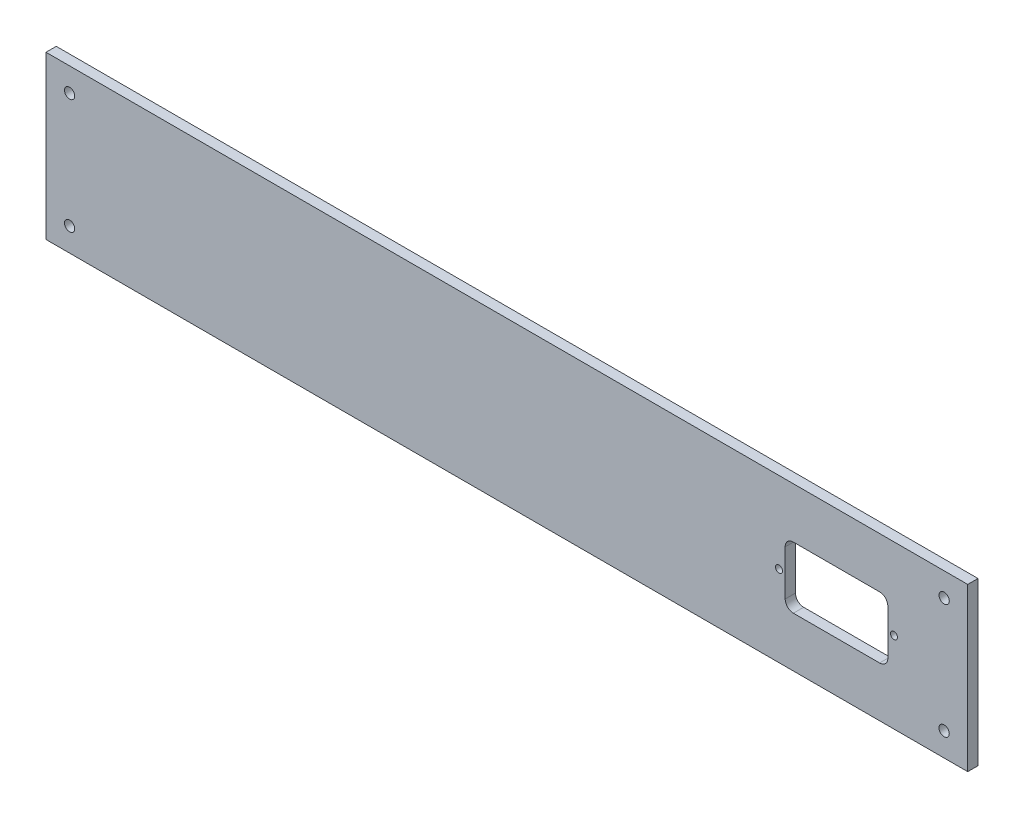
ISO-10303-21;
HEADER;
FILE_DESCRIPTION(('STEP AP214'),'2;1');
FILE_NAME('part.step','',(''),(''),'','','');
FILE_SCHEMA(('AUTOMOTIVE_DESIGN { 1 0 10303 214 1 1 1 1 }'));
ENDSEC;
DATA;
#1=APPLICATION_CONTEXT('core data for automotive mechanical design processes');
#2=APPLICATION_PROTOCOL_DEFINITION('international standard','automotive_design',2000,#1);
#3=PRODUCT_CONTEXT('',#1,'mechanical');
#4=PRODUCT('Part','Part','',(#3));
#5=PRODUCT_RELATED_PRODUCT_CATEGORY('part','',(#4));
#6=PRODUCT_DEFINITION_FORMATION('','',#4);
#7=PRODUCT_DEFINITION_CONTEXT('part definition',#1,'design');
#8=PRODUCT_DEFINITION('design','',#6,#7);
#9=PRODUCT_DEFINITION_SHAPE('','',#8);
#10=(LENGTH_UNIT() NAMED_UNIT(*) SI_UNIT(.MILLI.,.METRE.));
#11=(NAMED_UNIT(*) PLANE_ANGLE_UNIT() SI_UNIT($,.RADIAN.));
#12=(NAMED_UNIT(*) SI_UNIT($,.STERADIAN.) SOLID_ANGLE_UNIT());
#13=UNCERTAINTY_MEASURE_WITH_UNIT(LENGTH_MEASURE(1.E-05),#10,'distance_accuracy_value','');
#14=(GEOMETRIC_REPRESENTATION_CONTEXT(3) GLOBAL_UNCERTAINTY_ASSIGNED_CONTEXT((#13)) GLOBAL_UNIT_ASSIGNED_CONTEXT((#10,
#11,#12)) REPRESENTATION_CONTEXT('',''));
#15=CARTESIAN_POINT('',(0.,0.,0.));
#16=DIRECTION('',(0.,0.,1.));
#17=DIRECTION('',(1.,0.,0.));
#18=AXIS2_PLACEMENT_3D('',#15,#16,#17);
#19=CARTESIAN_POINT('',(0.,0.,5.));
#20=DIRECTION('',(0.,0.,-1.));
#21=DIRECTION('',(-1.,0.,0.));
#22=AXIS2_PLACEMENT_3D('',#19,#20,#21);
#23=PLANE('',#22);
#24=CARTESIAN_POINT('',(357.061242297895,39.5055064167184,5.));
#25=DIRECTION('',(0.,0.,-1.));
#26=DIRECTION('',(-1.,0.,0.));
#27=AXIS2_PLACEMENT_3D('',#24,#25,#26);
#28=CIRCLE('',#27,1.70000000000001);
#29=CARTESIAN_POINT('',(355.361242297895,39.5055064167184,5.));
#30=VERTEX_POINT('',#29);
#31=EDGE_CURVE('E279',#30,#30,#28,.T.);
#32=ORIENTED_EDGE('',*,*,#31,.T.);
#33=EDGE_LOOP('',(#32));
#34=FACE_BOUND('',#33,.T.);
#35=CARTESIAN_POINT('',(413.061242297895,39.5055064167184,5.));
#36=DIRECTION('',(0.,0.,-1.));
#37=DIRECTION('',(-1.,0.,0.));
#38=AXIS2_PLACEMENT_3D('',#35,#36,#37);
#39=CIRCLE('',#38,1.70000000000001);
#40=CARTESIAN_POINT('',(411.361242297895,39.5055064167184,5.));
#41=VERTEX_POINT('',#40);
#42=EDGE_CURVE('E180',#41,#41,#39,.T.);
#43=ORIENTED_EDGE('',*,*,#42,.T.);
#44=EDGE_LOOP('',(#43));
#45=FACE_BOUND('',#44,.T.);
#46=DIRECTION('',(0.,1.,0.));
#47=VECTOR('',#46,1.);
#48=CARTESIAN_POINT('',(360.074633799863,50.3949202589218,5.));
#49=LINE('',#48,#47);
#50=CARTESIAN_POINT('',(360.074633799863,28.3949202589218,5.));
#51=VERTEX_POINT('',#50);
#52=CARTESIAN_POINT('',(360.074633799863,50.3949202589218,5.));
#53=VERTEX_POINT('',#52);
#54=EDGE_CURVE('E143',#51,#53,#49,.T.);
#55=ORIENTED_EDGE('',*,*,#54,.T.);
#56=CARTESIAN_POINT('',(364.074633799863,50.3949202589218,5.));
#57=DIRECTION('',(0.,0.,-1.));
#58=DIRECTION('',(-1.,0.,0.));
#59=AXIS2_PLACEMENT_3D('',#56,#57,#58);
#60=CIRCLE('',#59,4.);
#61=CARTESIAN_POINT('',(364.074633799863,54.3949202589218,5.));
#62=VERTEX_POINT('',#61);
#63=EDGE_CURVE('E137',#53,#62,#60,.T.);
#64=ORIENTED_EDGE('',*,*,#63,.T.);
#65=DIRECTION('',(1.,0.,0.));
#66=VECTOR('',#65,1.);
#67=CARTESIAN_POINT('',(364.074633799863,54.3949202589218,5.));
#68=LINE('',#67,#66);
#69=CARTESIAN_POINT('',(406.074633799864,54.3949202589218,5.));
#70=VERTEX_POINT('',#69);
#71=EDGE_CURVE('E146',#62,#70,#68,.T.);
#72=ORIENTED_EDGE('',*,*,#71,.T.);
#73=CARTESIAN_POINT('',(406.074633799864,50.3949202589218,5.));
#74=DIRECTION('',(0.,0.,-1.));
#75=DIRECTION('',(1.,0.,0.));
#76=AXIS2_PLACEMENT_3D('',#73,#74,#75);
#77=CIRCLE('',#76,4.);
#78=CARTESIAN_POINT('',(410.074633799864,50.3949202589218,5.));
#79=VERTEX_POINT('',#78);
#80=EDGE_CURVE('E60',#70,#79,#77,.T.);
#81=ORIENTED_EDGE('',*,*,#80,.T.);
#82=DIRECTION('',(0.,-1.,0.));
#83=VECTOR('',#82,1.);
#84=CARTESIAN_POINT('',(410.074633799864,50.3949202589218,5.));
#85=LINE('',#84,#83);
#86=CARTESIAN_POINT('',(410.074633799864,28.3949202589218,5.));
#87=VERTEX_POINT('',#86);
#88=EDGE_CURVE('E165',#79,#87,#85,.T.);
#89=ORIENTED_EDGE('',*,*,#88,.T.);
#90=CARTESIAN_POINT('',(406.074633799864,28.3949202589218,5.));
#91=DIRECTION('',(0.,0.,-1.));
#92=DIRECTION('',(1.,0.,0.));
#93=AXIS2_PLACEMENT_3D('',#90,#91,#92);
#94=CIRCLE('',#93,4.);
#95=CARTESIAN_POINT('',(406.074633799864,24.3949202589218,5.));
#96=VERTEX_POINT('',#95);
#97=EDGE_CURVE('E168',#87,#96,#94,.T.);
#98=ORIENTED_EDGE('',*,*,#97,.T.);
#99=DIRECTION('',(-1.,0.,0.));
#100=VECTOR('',#99,1.);
#101=CARTESIAN_POINT('',(364.074633799863,24.3949202589218,5.));
#102=LINE('',#101,#100);
#103=CARTESIAN_POINT('',(364.074633799863,24.3949202589218,5.));
#104=VERTEX_POINT('',#103);
#105=EDGE_CURVE('E171',#96,#104,#102,.T.);
#106=ORIENTED_EDGE('',*,*,#105,.T.);
#107=CARTESIAN_POINT('',(364.074633799863,28.3949202589218,5.));
#108=DIRECTION('',(0.,0.,-1.));
#109=DIRECTION('',(1.,0.,0.));
#110=AXIS2_PLACEMENT_3D('',#107,#108,#109);
#111=CIRCLE('',#110,4.);
#112=EDGE_CURVE('E174',#104,#51,#111,.T.);
#113=ORIENTED_EDGE('',*,*,#112,.T.);
#114=EDGE_LOOP('',(#55,#64,#72,#81,#89,#98,#106,#113));
#115=FACE_BOUND('',#114,.T.);
#116=DIRECTION('',(1.,0.,0.));
#117=VECTOR('',#116,1.);
#118=CARTESIAN_POINT('',(449.,0.,5.));
#119=LINE('',#118,#117);
#120=CARTESIAN_POINT('',(0.,0.,5.));
#121=VERTEX_POINT('',#120);
#122=CARTESIAN_POINT('',(449.,0.,5.));
#123=VERTEX_POINT('',#122);
#124=EDGE_CURVE('E200',#121,#123,#119,.T.);
#125=ORIENTED_EDGE('',*,*,#124,.T.);
#126=DIRECTION('',(0.,1.,0.));
#127=VECTOR('',#126,1.);
#128=CARTESIAN_POINT('',(449.,79.,5.));
#129=LINE('',#128,#127);
#130=CARTESIAN_POINT('',(449.,79.,5.));
#131=VERTEX_POINT('',#130);
#132=EDGE_CURVE('E231',#123,#131,#129,.T.);
#133=ORIENTED_EDGE('',*,*,#132,.T.);
#134=DIRECTION('',(-1.,0.,0.));
#135=VECTOR('',#134,1.);
#136=CARTESIAN_POINT('',(0.,79.,5.));
#137=LINE('',#136,#135);
#138=CARTESIAN_POINT('',(0.,79.,5.));
#139=VERTEX_POINT('',#138);
#140=EDGE_CURVE('E214',#131,#139,#137,.T.);
#141=ORIENTED_EDGE('',*,*,#140,.T.);
#142=DIRECTION('',(0.,-1.,0.));
#143=VECTOR('',#142,1.);
#144=CARTESIAN_POINT('',(0.,0.,5.));
#145=LINE('',#144,#143);
#146=EDGE_CURVE('E205',#139,#121,#145,.T.);
#147=ORIENTED_EDGE('',*,*,#146,.T.);
#148=EDGE_LOOP('',(#125,#133,#141,#147));
#149=FACE_BOUND('',#148,.T.);
#150=CARTESIAN_POINT('',(11.5,67.5,5.));
#151=DIRECTION('',(0.,0.,1.));
#152=DIRECTION('',(1.,0.,0.));
#153=AXIS2_PLACEMENT_3D('',#150,#151,#152);
#154=CIRCLE('',#153,2.5);
#155=CARTESIAN_POINT('',(14.,67.5,5.));
#156=VERTEX_POINT('',#155);
#157=EDGE_CURVE('E240',#156,#156,#154,.T.);
#158=ORIENTED_EDGE('',*,*,#157,.F.);
#159=EDGE_LOOP('',(#158));
#160=FACE_BOUND('',#159,.T.);
#161=CARTESIAN_POINT('',(437.5,67.5,5.));
#162=DIRECTION('',(0.,0.,1.));
#163=DIRECTION('',(-1.,0.,0.));
#164=AXIS2_PLACEMENT_3D('',#161,#162,#163);
#165=CIRCLE('',#164,2.50000000000002);
#166=CARTESIAN_POINT('',(435.,67.5,5.));
#167=VERTEX_POINT('',#166);
#168=EDGE_CURVE('E246',#167,#167,#165,.T.);
#169=ORIENTED_EDGE('',*,*,#168,.F.);
#170=EDGE_LOOP('',(#169));
#171=FACE_BOUND('',#170,.T.);
#172=CARTESIAN_POINT('',(11.5,11.5,5.));
#173=DIRECTION('',(0.,0.,1.));
#174=DIRECTION('',(-1.,0.,0.));
#175=AXIS2_PLACEMENT_3D('',#172,#173,#174);
#176=CIRCLE('',#175,2.5);
#177=CARTESIAN_POINT('',(9.,11.5,5.));
#178=VERTEX_POINT('',#177);
#179=EDGE_CURVE('E252',#178,#178,#176,.T.);
#180=ORIENTED_EDGE('',*,*,#179,.F.);
#181=EDGE_LOOP('',(#180));
#182=FACE_BOUND('',#181,.T.);
#183=CARTESIAN_POINT('',(437.5,11.5,5.));
#184=DIRECTION('',(0.,0.,1.));
#185=DIRECTION('',(1.,0.,0.));
#186=AXIS2_PLACEMENT_3D('',#183,#184,#185);
#187=CIRCLE('',#186,2.50000000000002);
#188=CARTESIAN_POINT('',(440.,11.5,5.));
#189=VERTEX_POINT('',#188);
#190=EDGE_CURVE('E266',#189,#189,#187,.T.);
#191=ORIENTED_EDGE('',*,*,#190,.F.);
#192=EDGE_LOOP('',(#191));
#193=FACE_BOUND('',#192,.T.);
#194=ADVANCED_FACE('F45',(#34,#45,#115,#149,#160,#171,#182,#193),#23,.F.);
#195=CARTESIAN_POINT('',(0.,0.,0.));
#196=DIRECTION('',(0.,0.,-1.));
#197=DIRECTION('',(-1.,0.,0.));
#198=AXIS2_PLACEMENT_3D('',#195,#196,#197);
#199=PLANE('',#198);
#200=CARTESIAN_POINT('',(357.061242297895,39.5055064167184,0.));
#201=DIRECTION('',(0.,0.,-1.));
#202=DIRECTION('',(-1.,0.,0.));
#203=AXIS2_PLACEMENT_3D('',#200,#201,#202);
#204=CIRCLE('',#203,1.70000000000001);
#205=CARTESIAN_POINT('',(355.361242297895,39.5055064167184,0.));
#206=VERTEX_POINT('',#205);
#207=EDGE_CURVE('E274',#206,#206,#204,.T.);
#208=ORIENTED_EDGE('',*,*,#207,.F.);
#209=EDGE_LOOP('',(#208));
#210=FACE_BOUND('',#209,.T.);
#211=CARTESIAN_POINT('',(413.061242297895,39.5055064167184,0.));
#212=DIRECTION('',(0.,0.,-1.));
#213=DIRECTION('',(-1.,0.,0.));
#214=AXIS2_PLACEMENT_3D('',#211,#212,#213);
#215=CIRCLE('',#214,1.70000000000001);
#216=CARTESIAN_POINT('',(411.361242297895,39.5055064167184,0.));
#217=VERTEX_POINT('',#216);
#218=EDGE_CURVE('E160',#217,#217,#215,.T.);
#219=ORIENTED_EDGE('',*,*,#218,.F.);
#220=EDGE_LOOP('',(#219));
#221=FACE_BOUND('',#220,.T.);
#222=CARTESIAN_POINT('',(364.074633799863,50.3949202589218,0.));
#223=DIRECTION('',(0.,0.,-1.));
#224=DIRECTION('',(-1.,0.,0.));
#225=AXIS2_PLACEMENT_3D('',#222,#223,#224);
#226=CIRCLE('',#225,4.);
#227=CARTESIAN_POINT('',(360.074633799863,50.3949202589218,0.));
#228=VERTEX_POINT('',#227);
#229=CARTESIAN_POINT('',(364.074633799863,54.3949202589218,0.));
#230=VERTEX_POINT('',#229);
#231=EDGE_CURVE('E68',#228,#230,#226,.T.);
#232=ORIENTED_EDGE('',*,*,#231,.F.);
#233=DIRECTION('',(0.,1.,0.));
#234=VECTOR('',#233,1.);
#235=CARTESIAN_POINT('',(360.074633799863,50.3949202589218,0.));
#236=LINE('',#235,#234);
#237=CARTESIAN_POINT('',(360.074633799863,28.3949202589218,0.));
#238=VERTEX_POINT('',#237);
#239=EDGE_CURVE('E153',#238,#228,#236,.T.);
#240=ORIENTED_EDGE('',*,*,#239,.F.);
#241=CARTESIAN_POINT('',(364.074633799863,28.3949202589218,0.));
#242=DIRECTION('',(0.,0.,-1.));
#243=DIRECTION('',(1.,0.,0.));
#244=AXIS2_PLACEMENT_3D('',#241,#242,#243);
#245=CIRCLE('',#244,4.);
#246=CARTESIAN_POINT('',(364.074633799863,24.3949202589218,0.));
#247=VERTEX_POINT('',#246);
#248=EDGE_CURVE('E157',#247,#238,#245,.T.);
#249=ORIENTED_EDGE('',*,*,#248,.F.);
#250=DIRECTION('',(-1.,0.,0.));
#251=VECTOR('',#250,1.);
#252=CARTESIAN_POINT('',(364.074633799863,24.3949202589218,0.));
#253=LINE('',#252,#251);
#254=CARTESIAN_POINT('',(406.074633799864,24.3949202589218,0.));
#255=VERTEX_POINT('',#254);
#256=EDGE_CURVE('E311',#255,#247,#253,.T.);
#257=ORIENTED_EDGE('',*,*,#256,.F.);
#258=CARTESIAN_POINT('',(406.074633799864,28.3949202589218,0.));
#259=DIRECTION('',(0.,0.,-1.));
#260=DIRECTION('',(1.,0.,0.));
#261=AXIS2_PLACEMENT_3D('',#258,#259,#260);
#262=CIRCLE('',#261,4.);
#263=CARTESIAN_POINT('',(410.074633799864,28.3949202589218,0.));
#264=VERTEX_POINT('',#263);
#265=EDGE_CURVE('E307',#264,#255,#262,.T.);
#266=ORIENTED_EDGE('',*,*,#265,.F.);
#267=DIRECTION('',(0.,-1.,0.));
#268=VECTOR('',#267,1.);
#269=CARTESIAN_POINT('',(410.074633799864,50.3949202589218,0.));
#270=LINE('',#269,#268);
#271=CARTESIAN_POINT('',(410.074633799864,50.3949202589218,0.));
#272=VERTEX_POINT('',#271);
#273=EDGE_CURVE('E299',#272,#264,#270,.T.);
#274=ORIENTED_EDGE('',*,*,#273,.F.);
#275=CARTESIAN_POINT('',(406.074633799864,50.3949202589218,0.));
#276=DIRECTION('',(0.,0.,-1.));
#277=DIRECTION('',(1.,0.,0.));
#278=AXIS2_PLACEMENT_3D('',#275,#276,#277);
#279=CIRCLE('',#278,4.);
#280=CARTESIAN_POINT('',(406.074633799864,54.3949202589218,0.));
#281=VERTEX_POINT('',#280);
#282=EDGE_CURVE('E295',#281,#272,#279,.T.);
#283=ORIENTED_EDGE('',*,*,#282,.F.);
#284=DIRECTION('',(1.,0.,0.));
#285=VECTOR('',#284,1.);
#286=CARTESIAN_POINT('',(364.074633799863,54.3949202589218,0.));
#287=LINE('',#286,#285);
#288=EDGE_CURVE('E179',#230,#281,#287,.T.);
#289=ORIENTED_EDGE('',*,*,#288,.F.);
#290=EDGE_LOOP('',(#232,#240,#249,#257,#266,#274,#283,#289));
#291=FACE_BOUND('',#290,.T.);
#292=CARTESIAN_POINT('',(11.5,11.5,0.));
#293=DIRECTION('',(0.,0.,1.));
#294=DIRECTION('',(-1.,0.,0.));
#295=AXIS2_PLACEMENT_3D('',#292,#293,#294);
#296=CIRCLE('',#295,2.5);
#297=CARTESIAN_POINT('',(9.,11.5,0.));
#298=VERTEX_POINT('',#297);
#299=EDGE_CURVE('E285',#298,#298,#296,.T.);
#300=ORIENTED_EDGE('',*,*,#299,.T.);
#301=EDGE_LOOP('',(#300));
#302=FACE_BOUND('',#301,.T.);
#303=CARTESIAN_POINT('',(11.5,67.5,0.));
#304=DIRECTION('',(0.,0.,1.));
#305=DIRECTION('',(1.,0.,0.));
#306=AXIS2_PLACEMENT_3D('',#303,#304,#305);
#307=CIRCLE('',#306,2.5);
#308=CARTESIAN_POINT('',(14.,67.5,0.));
#309=VERTEX_POINT('',#308);
#310=EDGE_CURVE('E235',#309,#309,#307,.T.);
#311=ORIENTED_EDGE('',*,*,#310,.T.);
#312=EDGE_LOOP('',(#311));
#313=FACE_BOUND('',#312,.T.);
#314=DIRECTION('',(1.,0.,0.));
#315=VECTOR('',#314,1.);
#316=CARTESIAN_POINT('',(449.,0.,0.));
#317=LINE('',#316,#315);
#318=CARTESIAN_POINT('',(0.,0.,0.));
#319=VERTEX_POINT('',#318);
#320=CARTESIAN_POINT('',(449.,0.,0.));
#321=VERTEX_POINT('',#320);
#322=EDGE_CURVE('E222',#319,#321,#317,.T.);
#323=ORIENTED_EDGE('',*,*,#322,.F.);
#324=DIRECTION('',(0.,-1.,0.));
#325=VECTOR('',#324,1.);
#326=CARTESIAN_POINT('',(0.,0.,0.));
#327=LINE('',#326,#325);
#328=CARTESIAN_POINT('',(0.,79.,0.));
#329=VERTEX_POINT('',#328);
#330=EDGE_CURVE('E196',#329,#319,#327,.T.);
#331=ORIENTED_EDGE('',*,*,#330,.F.);
#332=DIRECTION('',(-1.,0.,0.));
#333=VECTOR('',#332,1.);
#334=CARTESIAN_POINT('',(0.,79.,0.));
#335=LINE('',#334,#333);
#336=CARTESIAN_POINT('',(449.,79.,0.));
#337=VERTEX_POINT('',#336);
#338=EDGE_CURVE('E192',#337,#329,#335,.T.);
#339=ORIENTED_EDGE('',*,*,#338,.F.);
#340=DIRECTION('',(0.,1.,0.));
#341=VECTOR('',#340,1.);
#342=CARTESIAN_POINT('',(449.,79.,0.));
#343=LINE('',#342,#341);
#344=EDGE_CURVE('E197',#321,#337,#343,.T.);
#345=ORIENTED_EDGE('',*,*,#344,.F.);
#346=EDGE_LOOP('',(#323,#331,#339,#345));
#347=FACE_BOUND('',#346,.T.);
#348=CARTESIAN_POINT('',(437.5,67.5,0.));
#349=DIRECTION('',(0.,0.,1.));
#350=DIRECTION('',(-1.,0.,0.));
#351=AXIS2_PLACEMENT_3D('',#348,#349,#350);
#352=CIRCLE('',#351,2.50000000000002);
#353=CARTESIAN_POINT('',(435.,67.5,0.));
#354=VERTEX_POINT('',#353);
#355=EDGE_CURVE('E247',#354,#354,#352,.T.);
#356=ORIENTED_EDGE('',*,*,#355,.T.);
#357=EDGE_LOOP('',(#356));
#358=FACE_BOUND('',#357,.T.);
#359=CARTESIAN_POINT('',(437.5,11.5,0.));
#360=DIRECTION('',(0.,0.,1.));
#361=DIRECTION('',(1.,0.,0.));
#362=AXIS2_PLACEMENT_3D('',#359,#360,#361);
#363=CIRCLE('',#362,2.50000000000002);
#364=CARTESIAN_POINT('',(440.,11.5,0.));
#365=VERTEX_POINT('',#364);
#366=EDGE_CURVE('E260',#365,#365,#363,.T.);
#367=ORIENTED_EDGE('',*,*,#366,.T.);
#368=EDGE_LOOP('',(#367));
#369=FACE_BOUND('',#368,.T.);
#370=ADVANCED_FACE('F219',(#210,#221,#291,#302,#313,#347,#358,#369),#199,.T.);
#371=CARTESIAN_POINT('',(449.,0.,5.));
#372=DIRECTION('',(0.,1.,0.));
#373=DIRECTION('',(-1.,0.,0.));
#374=AXIS2_PLACEMENT_3D('',#371,#372,#373);
#375=PLANE('',#374);
#376=ORIENTED_EDGE('',*,*,#322,.T.);
#377=DIRECTION('',(0.,0.,-1.));
#378=VECTOR('',#377,1.);
#379=CARTESIAN_POINT('',(449.,0.,5.));
#380=LINE('',#379,#378);
#381=EDGE_CURVE('E12',#123,#321,#380,.T.);
#382=ORIENTED_EDGE('',*,*,#381,.F.);
#383=ORIENTED_EDGE('',*,*,#124,.F.);
#384=DIRECTION('',(0.,0.,-1.));
#385=VECTOR('',#384,1.);
#386=CARTESIAN_POINT('',(0.,0.,5.));
#387=LINE('',#386,#385);
#388=EDGE_CURVE('E201',#121,#319,#387,.T.);
#389=ORIENTED_EDGE('',*,*,#388,.T.);
#390=EDGE_LOOP('',(#376,#382,#383,#389));
#391=FACE_BOUND('',#390,.T.);
#392=ADVANCED_FACE('F47',(#391),#375,.F.);
#393=CARTESIAN_POINT('',(449.,79.,5.));
#394=DIRECTION('',(-1.,0.,0.));
#395=DIRECTION('',(0.,0.,1.));
#396=AXIS2_PLACEMENT_3D('',#393,#394,#395);
#397=PLANE('',#396);
#398=ORIENTED_EDGE('',*,*,#344,.T.);
#399=DIRECTION('',(0.,0.,-1.));
#400=VECTOR('',#399,1.);
#401=CARTESIAN_POINT('',(449.,79.,5.));
#402=LINE('',#401,#400);
#403=EDGE_CURVE('E53',#131,#337,#402,.T.);
#404=ORIENTED_EDGE('',*,*,#403,.F.);
#405=ORIENTED_EDGE('',*,*,#132,.F.);
#406=ORIENTED_EDGE('',*,*,#381,.T.);
#407=EDGE_LOOP('',(#398,#404,#405,#406));
#408=FACE_BOUND('',#407,.T.);
#409=ADVANCED_FACE('F386',(#408),#397,.F.);
#410=CARTESIAN_POINT('',(0.,79.,5.));
#411=DIRECTION('',(0.,-1.,0.));
#412=DIRECTION('',(0.,0.,-1.));
#413=AXIS2_PLACEMENT_3D('',#410,#411,#412);
#414=PLANE('',#413);
#415=ORIENTED_EDGE('',*,*,#338,.T.);
#416=DIRECTION('',(0.,0.,-1.));
#417=VECTOR('',#416,1.);
#418=CARTESIAN_POINT('',(0.,79.,5.));
#419=LINE('',#418,#417);
#420=EDGE_CURVE('E204',#139,#329,#419,.T.);
#421=ORIENTED_EDGE('',*,*,#420,.F.);
#422=ORIENTED_EDGE('',*,*,#140,.F.);
#423=ORIENTED_EDGE('',*,*,#403,.T.);
#424=EDGE_LOOP('',(#415,#421,#422,#423));
#425=FACE_BOUND('',#424,.T.);
#426=ADVANCED_FACE('F212',(#425),#414,.F.);
#427=CARTESIAN_POINT('',(0.,0.,5.));
#428=DIRECTION('',(1.,0.,0.));
#429=DIRECTION('',(0.,1.,0.));
#430=AXIS2_PLACEMENT_3D('',#427,#428,#429);
#431=PLANE('',#430);
#432=ORIENTED_EDGE('',*,*,#330,.T.);
#433=ORIENTED_EDGE('',*,*,#388,.F.);
#434=ORIENTED_EDGE('',*,*,#146,.F.);
#435=ORIENTED_EDGE('',*,*,#420,.T.);
#436=EDGE_LOOP('',(#432,#433,#434,#435));
#437=FACE_BOUND('',#436,.T.);
#438=ADVANCED_FACE('F225',(#437),#431,.F.);
#439=CARTESIAN_POINT('',(11.5,67.5,5.));
#440=DIRECTION('',(0.,0.,-1.));
#441=DIRECTION('',(-1.,0.,0.));
#442=AXIS2_PLACEMENT_3D('',#439,#440,#441);
#443=CYLINDRICAL_SURFACE('',#442,2.5);
#444=ORIENTED_EDGE('',*,*,#157,.T.);
#445=EDGE_LOOP('',(#444));
#446=FACE_BOUND('',#445,.T.);
#447=ORIENTED_EDGE('',*,*,#310,.F.);
#448=EDGE_LOOP('',(#447));
#449=FACE_BOUND('',#448,.T.);
#450=ADVANCED_FACE('F380',(#446,#449),#443,.F.);
#451=CARTESIAN_POINT('',(437.5,67.5,5.));
#452=DIRECTION('',(0.,0.,-1.));
#453=DIRECTION('',(-1.,0.,0.));
#454=AXIS2_PLACEMENT_3D('',#451,#452,#453);
#455=CYLINDRICAL_SURFACE('',#454,2.50000000000002);
#456=ORIENTED_EDGE('',*,*,#168,.T.);
#457=EDGE_LOOP('',(#456));
#458=FACE_BOUND('',#457,.T.);
#459=ORIENTED_EDGE('',*,*,#355,.F.);
#460=EDGE_LOOP('',(#459));
#461=FACE_BOUND('',#460,.T.);
#462=ADVANCED_FACE('F415',(#458,#461),#455,.F.);
#463=CARTESIAN_POINT('',(11.5,11.5,5.));
#464=DIRECTION('',(0.,0.,-1.));
#465=DIRECTION('',(-1.,0.,0.));
#466=AXIS2_PLACEMENT_3D('',#463,#464,#465);
#467=CYLINDRICAL_SURFACE('',#466,2.5);
#468=ORIENTED_EDGE('',*,*,#179,.T.);
#469=EDGE_LOOP('',(#468));
#470=FACE_BOUND('',#469,.T.);
#471=ORIENTED_EDGE('',*,*,#299,.F.);
#472=EDGE_LOOP('',(#471));
#473=FACE_BOUND('',#472,.T.);
#474=ADVANCED_FACE('F405',(#470,#473),#467,.F.);
#475=CARTESIAN_POINT('',(437.5,11.5,5.));
#476=DIRECTION('',(0.,0.,-1.));
#477=DIRECTION('',(-1.,0.,0.));
#478=AXIS2_PLACEMENT_3D('',#475,#476,#477);
#479=CYLINDRICAL_SURFACE('',#478,2.50000000000002);
#480=ORIENTED_EDGE('',*,*,#190,.T.);
#481=EDGE_LOOP('',(#480));
#482=FACE_BOUND('',#481,.T.);
#483=ORIENTED_EDGE('',*,*,#366,.F.);
#484=EDGE_LOOP('',(#483));
#485=FACE_BOUND('',#484,.T.);
#486=ADVANCED_FACE('F402',(#482,#485),#479,.F.);
#487=CARTESIAN_POINT('',(364.074633799863,50.3949202589218,5.));
#488=DIRECTION('',(0.,0.,-1.));
#489=DIRECTION('',(-1.,0.,0.));
#490=AXIS2_PLACEMENT_3D('',#487,#488,#489);
#491=CYLINDRICAL_SURFACE('',#490,4.);
#492=ORIENTED_EDGE('',*,*,#231,.T.);
#493=DIRECTION('',(0.,0.,-1.));
#494=VECTOR('',#493,1.);
#495=CARTESIAN_POINT('',(364.074633799863,54.3949202589218,5.));
#496=LINE('',#495,#494);
#497=EDGE_CURVE('E133',#62,#230,#496,.T.);
#498=ORIENTED_EDGE('',*,*,#497,.F.);
#499=ORIENTED_EDGE('',*,*,#63,.F.);
#500=DIRECTION('',(0.,0.,-1.));
#501=VECTOR('',#500,1.);
#502=CARTESIAN_POINT('',(360.074633799863,50.3949202589218,5.));
#503=LINE('',#502,#501);
#504=EDGE_CURVE('E267',#53,#228,#503,.T.);
#505=ORIENTED_EDGE('',*,*,#504,.T.);
#506=EDGE_LOOP('',(#492,#498,#499,#505));
#507=FACE_BOUND('',#506,.T.);
#508=ADVANCED_FACE('F135',(#507),#491,.F.);
#509=CARTESIAN_POINT('',(360.074633799863,50.3949202589218,5.));
#510=DIRECTION('',(-1.,0.,0.));
#511=DIRECTION('',(0.,0.,1.));
#512=AXIS2_PLACEMENT_3D('',#509,#510,#511);
#513=PLANE('',#512);
#514=ORIENTED_EDGE('',*,*,#239,.T.);
#515=ORIENTED_EDGE('',*,*,#504,.F.);
#516=ORIENTED_EDGE('',*,*,#54,.F.);
#517=DIRECTION('',(0.,0.,-1.));
#518=VECTOR('',#517,1.);
#519=CARTESIAN_POINT('',(360.074633799863,28.3949202589218,5.));
#520=LINE('',#519,#518);
#521=EDGE_CURVE('E325',#51,#238,#520,.T.);
#522=ORIENTED_EDGE('',*,*,#521,.T.);
#523=EDGE_LOOP('',(#514,#515,#516,#522));
#524=FACE_BOUND('',#523,.T.);
#525=ADVANCED_FACE('F413',(#524),#513,.F.);
#526=CARTESIAN_POINT('',(364.074633799863,28.3949202589218,5.));
#527=DIRECTION('',(0.,0.,-1.));
#528=DIRECTION('',(-1.,0.,0.));
#529=AXIS2_PLACEMENT_3D('',#526,#527,#528);
#530=CYLINDRICAL_SURFACE('',#529,4.);
#531=ORIENTED_EDGE('',*,*,#248,.T.);
#532=ORIENTED_EDGE('',*,*,#521,.F.);
#533=ORIENTED_EDGE('',*,*,#112,.F.);
#534=DIRECTION('',(0.,0.,-1.));
#535=VECTOR('',#534,1.);
#536=CARTESIAN_POINT('',(364.074633799863,24.3949202589218,5.));
#537=LINE('',#536,#535);
#538=EDGE_CURVE('E327',#104,#247,#537,.T.);
#539=ORIENTED_EDGE('',*,*,#538,.T.);
#540=EDGE_LOOP('',(#531,#532,#533,#539));
#541=FACE_BOUND('',#540,.T.);
#542=ADVANCED_FACE('F355',(#541),#530,.F.);
#543=CARTESIAN_POINT('',(364.074633799863,24.3949202589218,5.));
#544=DIRECTION('',(0.,-1.,0.));
#545=DIRECTION('',(1.,0.,0.));
#546=AXIS2_PLACEMENT_3D('',#543,#544,#545);
#547=PLANE('',#546);
#548=ORIENTED_EDGE('',*,*,#256,.T.);
#549=ORIENTED_EDGE('',*,*,#538,.F.);
#550=ORIENTED_EDGE('',*,*,#105,.F.);
#551=DIRECTION('',(0.,0.,-1.));
#552=VECTOR('',#551,1.);
#553=CARTESIAN_POINT('',(406.074633799864,24.3949202589218,5.));
#554=LINE('',#553,#552);
#555=EDGE_CURVE('E329',#96,#255,#554,.T.);
#556=ORIENTED_EDGE('',*,*,#555,.T.);
#557=EDGE_LOOP('',(#548,#549,#550,#556));
#558=FACE_BOUND('',#557,.T.);
#559=ADVANCED_FACE('F350',(#558),#547,.F.);
#560=CARTESIAN_POINT('',(406.074633799864,28.3949202589218,5.));
#561=DIRECTION('',(0.,0.,-1.));
#562=DIRECTION('',(-1.,0.,0.));
#563=AXIS2_PLACEMENT_3D('',#560,#561,#562);
#564=CYLINDRICAL_SURFACE('',#563,4.);
#565=ORIENTED_EDGE('',*,*,#265,.T.);
#566=ORIENTED_EDGE('',*,*,#555,.F.);
#567=ORIENTED_EDGE('',*,*,#97,.F.);
#568=DIRECTION('',(0.,0.,-1.));
#569=VECTOR('',#568,1.);
#570=CARTESIAN_POINT('',(410.074633799864,28.3949202589218,5.));
#571=LINE('',#570,#569);
#572=EDGE_CURVE('E331',#87,#264,#571,.T.);
#573=ORIENTED_EDGE('',*,*,#572,.T.);
#574=EDGE_LOOP('',(#565,#566,#567,#573));
#575=FACE_BOUND('',#574,.T.);
#576=ADVANCED_FACE('F359',(#575),#564,.F.);
#577=CARTESIAN_POINT('',(410.074633799864,50.3949202589218,5.));
#578=DIRECTION('',(1.,0.,0.));
#579=DIRECTION('',(0.,0.,-1.));
#580=AXIS2_PLACEMENT_3D('',#577,#578,#579);
#581=PLANE('',#580);
#582=ORIENTED_EDGE('',*,*,#273,.T.);
#583=ORIENTED_EDGE('',*,*,#572,.F.);
#584=ORIENTED_EDGE('',*,*,#88,.F.);
#585=DIRECTION('',(0.,0.,-1.));
#586=VECTOR('',#585,1.);
#587=CARTESIAN_POINT('',(410.074633799864,50.3949202589218,5.));
#588=LINE('',#587,#586);
#589=EDGE_CURVE('E333',#79,#272,#588,.T.);
#590=ORIENTED_EDGE('',*,*,#589,.T.);
#591=EDGE_LOOP('',(#582,#583,#584,#590));
#592=FACE_BOUND('',#591,.T.);
#593=ADVANCED_FACE('F360',(#592),#581,.F.);
#594=CARTESIAN_POINT('',(406.074633799864,50.3949202589218,5.));
#595=DIRECTION('',(0.,0.,-1.));
#596=DIRECTION('',(-1.,0.,0.));
#597=AXIS2_PLACEMENT_3D('',#594,#595,#596);
#598=CYLINDRICAL_SURFACE('',#597,4.);
#599=ORIENTED_EDGE('',*,*,#282,.T.);
#600=ORIENTED_EDGE('',*,*,#589,.F.);
#601=ORIENTED_EDGE('',*,*,#80,.F.);
#602=DIRECTION('',(0.,0.,-1.));
#603=VECTOR('',#602,1.);
#604=CARTESIAN_POINT('',(406.074633799864,54.3949202589218,5.));
#605=LINE('',#604,#603);
#606=EDGE_CURVE('E142',#70,#281,#605,.T.);
#607=ORIENTED_EDGE('',*,*,#606,.T.);
#608=EDGE_LOOP('',(#599,#600,#601,#607));
#609=FACE_BOUND('',#608,.T.);
#610=ADVANCED_FACE('F335',(#609),#598,.F.);
#611=CARTESIAN_POINT('',(364.074633799863,54.3949202589218,5.));
#612=DIRECTION('',(0.,1.,0.));
#613=DIRECTION('',(-1.,0.,0.));
#614=AXIS2_PLACEMENT_3D('',#611,#612,#613);
#615=PLANE('',#614);
#616=ORIENTED_EDGE('',*,*,#288,.T.);
#617=ORIENTED_EDGE('',*,*,#606,.F.);
#618=ORIENTED_EDGE('',*,*,#71,.F.);
#619=ORIENTED_EDGE('',*,*,#497,.T.);
#620=EDGE_LOOP('',(#616,#617,#618,#619));
#621=FACE_BOUND('',#620,.T.);
#622=ADVANCED_FACE('F147',(#621),#615,.F.);
#623=CARTESIAN_POINT('',(413.061242297895,39.5055064167184,5.));
#624=DIRECTION('',(0.,0.,-1.));
#625=DIRECTION('',(-1.,0.,0.));
#626=AXIS2_PLACEMENT_3D('',#623,#624,#625);
#627=CYLINDRICAL_SURFACE('',#626,1.70000000000001);
#628=ORIENTED_EDGE('',*,*,#42,.F.);
#629=EDGE_LOOP('',(#628));
#630=FACE_BOUND('',#629,.T.);
#631=ORIENTED_EDGE('',*,*,#218,.T.);
#632=EDGE_LOOP('',(#631));
#633=FACE_BOUND('',#632,.T.);
#634=ADVANCED_FACE('F516',(#630,#633),#627,.F.);
#635=CARTESIAN_POINT('',(357.061242297895,39.5055064167184,5.));
#636=DIRECTION('',(0.,0.,-1.));
#637=DIRECTION('',(-1.,0.,0.));
#638=AXIS2_PLACEMENT_3D('',#635,#636,#637);
#639=CYLINDRICAL_SURFACE('',#638,1.70000000000001);
#640=ORIENTED_EDGE('',*,*,#31,.F.);
#641=EDGE_LOOP('',(#640));
#642=FACE_BOUND('',#641,.T.);
#643=ORIENTED_EDGE('',*,*,#207,.T.);
#644=EDGE_LOOP('',(#643));
#645=FACE_BOUND('',#644,.T.);
#646=ADVANCED_FACE('F524',(#642,#645),#639,.F.);
#647=CLOSED_SHELL('',(#194,#370,#392,#409,#426,#438,#450,#462,#474,#486,#508,#525,#542,#559,
#576,#593,#610,#622,#634,#646));
#648=MANIFOLD_SOLID_BREP('B2',#647);
#649=ADVANCED_BREP_SHAPE_REPRESENTATION('',(#18,#648),#14);
#650=SHAPE_DEFINITION_REPRESENTATION(#9,#649);
ENDSEC;
END-ISO-10303-21;
